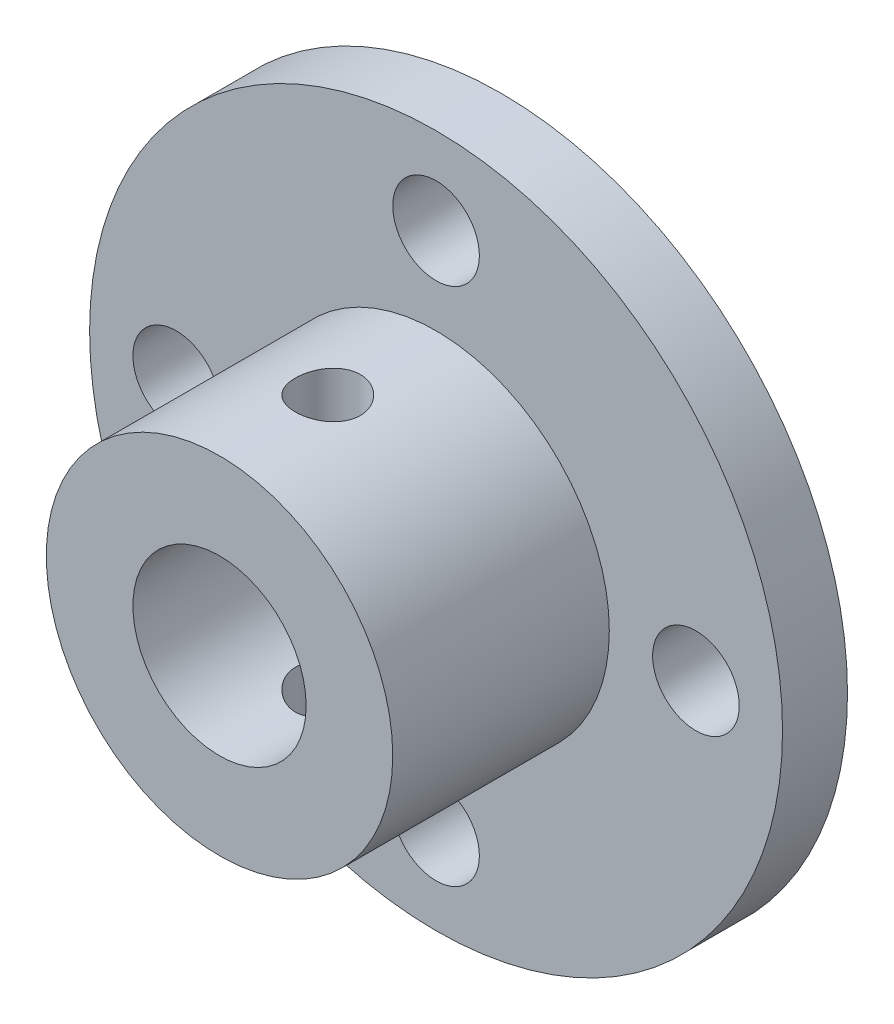
ISO-10303-21;
HEADER;
FILE_DESCRIPTION(('STEP AP214'),'2;1');
FILE_NAME('part.step','',(''),(''),'','','');
FILE_SCHEMA(('AUTOMOTIVE_DESIGN { 1 0 10303 214 1 1 1 1 }'));
ENDSEC;
DATA;
#1=APPLICATION_CONTEXT('core data for automotive mechanical design processes');
#2=APPLICATION_PROTOCOL_DEFINITION('international standard','automotive_design',2000,#1);
#3=PRODUCT_CONTEXT('',#1,'mechanical');
#4=PRODUCT('Part','Part','',(#3));
#5=PRODUCT_RELATED_PRODUCT_CATEGORY('part','',(#4));
#6=PRODUCT_DEFINITION_FORMATION('','',#4);
#7=PRODUCT_DEFINITION_CONTEXT('part definition',#1,'design');
#8=PRODUCT_DEFINITION('design','',#6,#7);
#9=PRODUCT_DEFINITION_SHAPE('','',#8);
#10=(LENGTH_UNIT() NAMED_UNIT(*) SI_UNIT(.MILLI.,.METRE.));
#11=(NAMED_UNIT(*) PLANE_ANGLE_UNIT() SI_UNIT($,.RADIAN.));
#12=(NAMED_UNIT(*) SI_UNIT($,.STERADIAN.) SOLID_ANGLE_UNIT());
#13=UNCERTAINTY_MEASURE_WITH_UNIT(LENGTH_MEASURE(1.E-05),#10,'distance_accuracy_value','');
#14=(GEOMETRIC_REPRESENTATION_CONTEXT(3) GLOBAL_UNCERTAINTY_ASSIGNED_CONTEXT((#13)) GLOBAL_UNIT_ASSIGNED_CONTEXT((#10,
#11,#12)) REPRESENTATION_CONTEXT('',''));
#15=CARTESIAN_POINT('',(0.,0.,0.));
#16=DIRECTION('',(0.,0.,1.));
#17=DIRECTION('',(1.,0.,0.));
#18=AXIS2_PLACEMENT_3D('',#15,#16,#17);
#19=CARTESIAN_POINT('',(0.,0.,3.));
#20=DIRECTION('',(0.,0.,-1.));
#21=DIRECTION('',(-1.,0.,0.));
#22=AXIS2_PLACEMENT_3D('',#19,#20,#21);
#23=CYLINDRICAL_SURFACE('',#22,16.);
#24=CARTESIAN_POINT('',(0.,0.,3.));
#25=DIRECTION('',(0.,0.,1.));
#26=DIRECTION('',(1.,0.,0.));
#27=AXIS2_PLACEMENT_3D('',#24,#25,#26);
#28=CIRCLE('',#27,16.);
#29=CARTESIAN_POINT('',(16.,0.,3.));
#30=VERTEX_POINT('',#29);
#31=EDGE_CURVE('E42',#30,#30,#28,.T.);
#32=ORIENTED_EDGE('',*,*,#31,.F.);
#33=EDGE_LOOP('',(#32));
#34=FACE_BOUND('',#33,.T.);
#35=CARTESIAN_POINT('',(0.,0.,0.));
#36=DIRECTION('',(0.,0.,1.));
#37=DIRECTION('',(1.,0.,0.));
#38=AXIS2_PLACEMENT_3D('',#35,#36,#37);
#39=CIRCLE('',#38,16.);
#40=CARTESIAN_POINT('',(16.,0.,0.));
#41=VERTEX_POINT('',#40);
#42=EDGE_CURVE('E47',#41,#41,#39,.T.);
#43=ORIENTED_EDGE('',*,*,#42,.T.);
#44=EDGE_LOOP('',(#43));
#45=FACE_BOUND('',#44,.T.);
#46=ADVANCED_FACE('F30',(#34,#45),#23,.T.);
#47=CARTESIAN_POINT('',(0.,0.,3.));
#48=DIRECTION('',(0.,0.,1.));
#49=DIRECTION('',(1.,0.,0.));
#50=AXIS2_PLACEMENT_3D('',#47,#48,#49);
#51=PLANE('',#50);
#52=CARTESIAN_POINT('',(12.,0.,3.));
#53=DIRECTION('',(0.,0.,1.));
#54=DIRECTION('',(1.,0.,0.));
#55=AXIS2_PLACEMENT_3D('',#52,#53,#54);
#56=CIRCLE('',#55,2.);
#57=CARTESIAN_POINT('',(14.,0.,3.));
#58=VERTEX_POINT('',#57);
#59=EDGE_CURVE('E210',#58,#58,#56,.T.);
#60=ORIENTED_EDGE('',*,*,#59,.F.);
#61=EDGE_LOOP('',(#60));
#62=FACE_BOUND('',#61,.T.);
#63=CARTESIAN_POINT('',(0.,12.,3.));
#64=DIRECTION('',(0.,0.,1.));
#65=DIRECTION('',(1.,0.,0.));
#66=AXIS2_PLACEMENT_3D('',#63,#64,#65);
#67=CIRCLE('',#66,2.);
#68=CARTESIAN_POINT('',(2.,12.,3.));
#69=VERTEX_POINT('',#68);
#70=EDGE_CURVE('E212',#69,#69,#67,.T.);
#71=ORIENTED_EDGE('',*,*,#70,.F.);
#72=EDGE_LOOP('',(#71));
#73=FACE_BOUND('',#72,.T.);
#74=CARTESIAN_POINT('',(-12.,0.,3.));
#75=DIRECTION('',(0.,0.,1.));
#76=DIRECTION('',(1.,0.,0.));
#77=AXIS2_PLACEMENT_3D('',#74,#75,#76);
#78=CIRCLE('',#77,2.);
#79=CARTESIAN_POINT('',(-10.,0.,3.));
#80=VERTEX_POINT('',#79);
#81=EDGE_CURVE('E215',#80,#80,#78,.T.);
#82=ORIENTED_EDGE('',*,*,#81,.F.);
#83=EDGE_LOOP('',(#82));
#84=FACE_BOUND('',#83,.T.);
#85=CARTESIAN_POINT('',(0.,-12.,3.));
#86=DIRECTION('',(0.,0.,1.));
#87=DIRECTION('',(1.,0.,0.));
#88=AXIS2_PLACEMENT_3D('',#85,#86,#87);
#89=CIRCLE('',#88,2.);
#90=CARTESIAN_POINT('',(2.,-12.,3.));
#91=VERTEX_POINT('',#90);
#92=EDGE_CURVE('E57',#91,#91,#89,.T.);
#93=ORIENTED_EDGE('',*,*,#92,.F.);
#94=EDGE_LOOP('',(#93));
#95=FACE_BOUND('',#94,.T.);
#96=CARTESIAN_POINT('',(0.,0.,3.));
#97=DIRECTION('',(0.,0.,1.));
#98=DIRECTION('',(1.,0.,0.));
#99=AXIS2_PLACEMENT_3D('',#96,#97,#98);
#100=CIRCLE('',#99,8.);
#101=CARTESIAN_POINT('',(8.,0.,3.));
#102=VERTEX_POINT('',#101);
#103=EDGE_CURVE('E10',#102,#102,#100,.T.);
#104=ORIENTED_EDGE('',*,*,#103,.F.);
#105=EDGE_LOOP('',(#104));
#106=FACE_BOUND('',#105,.T.);
#107=ORIENTED_EDGE('',*,*,#31,.T.);
#108=EDGE_LOOP('',(#107));
#109=FACE_BOUND('',#108,.T.);
#110=ADVANCED_FACE('F99',(#62,#73,#84,#95,#106,#109),#51,.T.);
#111=CARTESIAN_POINT('',(0.,0.,0.));
#112=DIRECTION('',(0.,0.,1.));
#113=DIRECTION('',(1.,0.,0.));
#114=AXIS2_PLACEMENT_3D('',#111,#112,#113);
#115=PLANE('',#114);
#116=CARTESIAN_POINT('',(12.,0.,0.));
#117=DIRECTION('',(0.,0.,1.));
#118=DIRECTION('',(1.,0.,0.));
#119=AXIS2_PLACEMENT_3D('',#116,#117,#118);
#120=CIRCLE('',#119,2.);
#121=CARTESIAN_POINT('',(14.,0.,0.));
#122=VERTEX_POINT('',#121);
#123=EDGE_CURVE('E224',#122,#122,#120,.T.);
#124=ORIENTED_EDGE('',*,*,#123,.T.);
#125=EDGE_LOOP('',(#124));
#126=FACE_BOUND('',#125,.T.);
#127=CARTESIAN_POINT('',(0.,12.,0.));
#128=DIRECTION('',(0.,0.,1.));
#129=DIRECTION('',(1.,0.,0.));
#130=AXIS2_PLACEMENT_3D('',#127,#128,#129);
#131=CIRCLE('',#130,2.);
#132=CARTESIAN_POINT('',(2.,12.,0.));
#133=VERTEX_POINT('',#132);
#134=EDGE_CURVE('E225',#133,#133,#131,.T.);
#135=ORIENTED_EDGE('',*,*,#134,.T.);
#136=EDGE_LOOP('',(#135));
#137=FACE_BOUND('',#136,.T.);
#138=CARTESIAN_POINT('',(-12.,0.,0.));
#139=DIRECTION('',(0.,0.,1.));
#140=DIRECTION('',(1.,0.,0.));
#141=AXIS2_PLACEMENT_3D('',#138,#139,#140);
#142=CIRCLE('',#141,2.);
#143=CARTESIAN_POINT('',(-10.,0.,0.));
#144=VERTEX_POINT('',#143);
#145=EDGE_CURVE('E228',#144,#144,#142,.T.);
#146=ORIENTED_EDGE('',*,*,#145,.T.);
#147=EDGE_LOOP('',(#146));
#148=FACE_BOUND('',#147,.T.);
#149=CARTESIAN_POINT('',(0.,-12.,0.));
#150=DIRECTION('',(0.,0.,1.));
#151=DIRECTION('',(1.,0.,0.));
#152=AXIS2_PLACEMENT_3D('',#149,#150,#151);
#153=CIRCLE('',#152,2.);
#154=CARTESIAN_POINT('',(2.,-12.,0.));
#155=VERTEX_POINT('',#154);
#156=EDGE_CURVE('E230',#155,#155,#153,.T.);
#157=ORIENTED_EDGE('',*,*,#156,.T.);
#158=EDGE_LOOP('',(#157));
#159=FACE_BOUND('',#158,.T.);
#160=CARTESIAN_POINT('',(0.,0.,0.));
#161=DIRECTION('',(0.,0.,1.));
#162=DIRECTION('',(1.,0.,0.));
#163=AXIS2_PLACEMENT_3D('',#160,#161,#162);
#164=CIRCLE('',#163,4.);
#165=CARTESIAN_POINT('',(4.,0.,0.));
#166=VERTEX_POINT('',#165);
#167=EDGE_CURVE('E58',#166,#166,#164,.T.);
#168=ORIENTED_EDGE('',*,*,#167,.T.);
#169=EDGE_LOOP('',(#168));
#170=FACE_BOUND('',#169,.T.);
#171=ORIENTED_EDGE('',*,*,#42,.F.);
#172=EDGE_LOOP('',(#171));
#173=FACE_BOUND('',#172,.T.);
#174=ADVANCED_FACE('F97',(#126,#137,#148,#159,#170,#173),#115,.F.);
#175=CARTESIAN_POINT('',(0.,0.,13.));
#176=DIRECTION('',(0.,0.,-1.));
#177=DIRECTION('',(-1.,0.,0.));
#178=AXIS2_PLACEMENT_3D('',#175,#176,#177);
#179=CYLINDRICAL_SURFACE('',#178,8.);
#180=CARTESIAN_POINT('',(0.,-8.,9.5));
#181=CARTESIAN_POINT('',(0.0834717464654709,-7.99999848833852,9.49999681041172));
#182=CARTESIAN_POINT('',(0.166984992730099,-7.99868009921714,9.49300892338062));
#183=CARTESIAN_POINT('',(0.331658129841797,-7.9935478589052,9.46526000488165));
#184=CARTESIAN_POINT('',(0.412815974152225,-7.98973190166897,9.44448734936027));
#185=CARTESIAN_POINT('',(0.570372961851801,-7.98003138765458,9.38982729874066));
#186=CARTESIAN_POINT('',(0.646776330685344,-7.97414869946483,9.35595174754746));
#187=CARTESIAN_POINT('',(0.792807973094007,-7.96095710599783,9.27608112307718));
#188=CARTESIAN_POINT('',(0.862436794477323,-7.9536483161829,9.23008703085518));
#189=CARTESIAN_POINT('',(0.993783715930502,-7.93831336430504,9.12670023199632));
#190=CARTESIAN_POINT('',(1.05540895503183,-7.93028034856351,9.06919055532986));
#191=CARTESIAN_POINT('',(1.16819606135369,-7.9144531845865,8.94465669091244));
#192=CARTESIAN_POINT('',(1.21935717689241,-7.90665905354527,8.87763182023071));
#193=CARTESIAN_POINT('',(1.31014998665793,-7.89212551245005,8.73531391163603));
#194=CARTESIAN_POINT('',(1.34968721969605,-7.88539493886182,8.65995962968276));
#195=CARTESIAN_POINT('',(1.41550524332283,-7.87384713211987,8.50353108482321));
#196=CARTESIAN_POINT('',(1.44178717713098,-7.86902973396962,8.42245731588878));
#197=CARTESIAN_POINT('',(1.480050535035,-7.8619226957455,8.25788476908559));
#198=CARTESIAN_POINT('',(1.49219390192039,-7.85960445366405,8.17442490279654));
#199=CARTESIAN_POINT('',(1.50233808095346,-7.85767197152761,8.00662261519175));
#200=CARTESIAN_POINT('',(1.50034016135374,-7.8580574889876,7.9222802736977));
#201=CARTESIAN_POINT('',(1.48238979602362,-7.86146292701753,7.75628047473396));
#202=CARTESIAN_POINT('',(1.46662149996045,-7.86444808147334,7.67460228569985));
#203=CARTESIAN_POINT('',(1.42186799396207,-7.87266183284666,7.51507158021739));
#204=CARTESIAN_POINT('',(1.39288222239499,-7.87789052509516,7.4372192264907));
#205=CARTESIAN_POINT('',(1.322336471793,-7.89003855292588,7.28701132099974));
#206=CARTESIAN_POINT('',(1.28070213532456,-7.89696783823366,7.21469152941919));
#207=CARTESIAN_POINT('',(1.18609368930416,-7.91172971602918,7.07799527145977));
#208=CARTESIAN_POINT('',(1.13311842889266,-7.91956240015522,7.0136196122852));
#209=CARTESIAN_POINT('',(1.01633905685298,-7.93540001272164,6.89357504432754));
#210=CARTESIAN_POINT('',(0.952377436860683,-7.9434057102403,6.83805934754826));
#211=CARTESIAN_POINT('',(0.815968037098827,-7.95857386108318,6.73852275932459));
#212=CARTESIAN_POINT('',(0.74352017225577,-7.96573630595245,6.69450198312958));
#213=CARTESIAN_POINT('',(0.592034988874669,-7.97842539677509,6.61918224612998));
#214=CARTESIAN_POINT('',(0.512989564446494,-7.98394999136289,6.58789922088211));
#215=CARTESIAN_POINT('',(0.350639115398697,-7.99272505402719,6.53909790690784));
#216=CARTESIAN_POINT('',(0.267334544277787,-7.99597576367994,6.52157815595464));
#217=CARTESIAN_POINT('',(0.100148652903386,-7.99980360641981,6.50101396898173));
#218=CARTESIAN_POINT('',(0.0162940126341359,-8.00041950912279,6.49775960847027));
#219=CARTESIAN_POINT('',(-0.150761248092183,-7.99901543598228,6.50525547954765));
#220=CARTESIAN_POINT('',(-0.233961900480385,-7.99699558964431,6.51600502306526));
#221=CARTESIAN_POINT('',(-0.396681573218217,-7.99057111500406,6.55102903518337));
#222=CARTESIAN_POINT('',(-0.476224261046063,-7.98618522374031,6.57519728253781));
#223=CARTESIAN_POINT('',(-0.630128631824633,-7.97551842212498,6.63625770677879));
#224=CARTESIAN_POINT('',(-0.704489962595103,-7.96923738311334,6.67315074756578));
#225=CARTESIAN_POINT('',(-0.846816671513214,-7.95538030357666,6.75907812815951));
#226=CARTESIAN_POINT('',(-0.914703277015121,-7.94779086174563,6.80824073853684));
#227=CARTESIAN_POINT('',(-1.04133832326455,-7.93219343489712,6.91713813736236));
#228=CARTESIAN_POINT('',(-1.10008590976087,-7.92418541084687,6.97687391300133));
#229=CARTESIAN_POINT('',(-1.20757295872048,-7.9085247569745,7.10617231891143));
#230=CARTESIAN_POINT('',(-1.25616916218577,-7.90087825860257,7.17585490812539));
#231=CARTESIAN_POINT('',(-1.34096675057787,-7.88692985578532,7.32251762452375));
#232=CARTESIAN_POINT('',(-1.37716859613924,-7.8806279013735,7.39949748037047));
#233=CARTESIAN_POINT('',(-1.43594673512823,-7.87013024209574,7.55820586724254));
#234=CARTESIAN_POINT('',(-1.45858868794786,-7.86592440436878,7.63990937955933));
#235=CARTESIAN_POINT('',(-1.48980679326235,-7.86007203802415,7.8060472225214));
#236=CARTESIAN_POINT('',(-1.49838453270708,-7.8584252206579,7.8904812439704));
#237=CARTESIAN_POINT('',(-1.50117762148355,-7.85789199803857,8.05824833144151));
#238=CARTESIAN_POINT('',(-1.49561895003499,-7.85896215974293,8.14157758095699));
#239=CARTESIAN_POINT('',(-1.47079175378803,-7.86364600659998,8.30609142204529));
#240=CARTESIAN_POINT('',(-1.45152331089332,-7.86725967655747,8.38727602642744));
#241=CARTESIAN_POINT('',(-1.39991887583263,-7.8766050802318,8.54507448479548));
#242=CARTESIAN_POINT('',(-1.36760735397252,-7.88233284594965,8.62169659134577));
#243=CARTESIAN_POINT('',(-1.29085868912204,-7.8952638755184,8.76846825424084));
#244=CARTESIAN_POINT('',(-1.24642068948186,-7.90246724360119,8.83861735284478));
#245=CARTESIAN_POINT('',(-1.14589487339535,-7.91767266107745,8.97158368004229));
#246=CARTESIAN_POINT('',(-1.08964259864303,-7.92568505353043,9.0342754125671));
#247=CARTESIAN_POINT('',(-0.96742792674229,-7.94152833918735,9.14940516246452));
#248=CARTESIAN_POINT('',(-0.901463301891616,-7.94935919027328,9.20184082098014));
#249=CARTESIAN_POINT('',(-0.760984945071872,-7.96403975968049,9.29541095262706));
#250=CARTESIAN_POINT('',(-0.686399590640516,-7.97088000990561,9.33643942849064));
#251=CARTESIAN_POINT('',(-0.531290113653833,-7.98271619380687,9.40531763660514));
#252=CARTESIAN_POINT('',(-0.450771651705247,-7.98771385879037,9.43317974704691));
#253=CARTESIAN_POINT('',(-0.308347202825154,-7.99428290707632,9.46927731441867));
#254=CARTESIAN_POINT('',(-0.24727381025187,-7.99641470878206,9.4807786303128));
#255=CARTESIAN_POINT('',(-0.124141247115158,-7.9992737995401,9.49614106211645));
#256=CARTESIAN_POINT('',(-0.0620821016527095,-8.00000112429805,9.50000237225591));
#257=CARTESIAN_POINT('',(0.,-8.,9.5));
#258=B_SPLINE_CURVE_WITH_KNOTS('',3,(#180,#181,#182,#183,#184,#185,#186,#187,#188,#189,#190,
#191,#192,#193,#194,#195,#196,#197,#198,#199,#200,#201,#202,#203,#204,#205,#206,#207,#208,#209,
#210,#211,#212,#213,#214,#215,#216,#217,#218,#219,#220,#221,#222,#223,#224,#225,#226,#227,#228,
#229,#230,#231,#232,#233,#234,#235,#236,#237,#238,#239,#240,#241,#242,#243,#244,#245,#246,#247,
#248,#249,#250,#251,#252,#253,#254,#255,#256,#257),.UNSPECIFIED.,.T.,.F.,(4,2,2,2,2,2,2,2,2,2,2,
2,2,2,2,2,2,2,2,2,2,2,2,2,2,2,2,2,2,2,2,2,2,2,2,2,2,2,4),(0.,0.250188200964924,
0.500587642535452,0.750761271230907,1.00091465336891,1.2537511801363,1.50660586283617,
1.76146190504357,2.01629596311948,2.26818151445336,2.52004447587256,2.76859000612765,
3.01714609846786,3.2671926262953,3.51726454049859,3.77127768464077,4.02529337544948,
4.27962588321699,4.53393136673745,4.78448174076097,5.03501980464583,5.28360233907828,
5.53220175338032,5.78351778017708,6.03485728413098,6.28953436987299,6.54420198954945,
6.79762627818559,7.05102196946512,7.30039252231748,7.54976158541506,7.79866496207692,
8.04758592655423,8.3002336996638,8.55293951262255,8.80792048916315,9.06266126931173,
9.24874344524409,9.43482089039541),.UNSPECIFIED.);
#259=CARTESIAN_POINT('',(0.,-8.,9.5));
#260=VERTEX_POINT('',#259);
#261=EDGE_CURVE('E87',#260,#260,#258,.T.);
#262=ORIENTED_EDGE('',*,*,#261,.T.);
#263=EDGE_LOOP('',(#262));
#264=FACE_BOUND('',#263,.T.);
#265=CARTESIAN_POINT('',(0.,8.,9.5));
#266=CARTESIAN_POINT('',(-0.0834717464654709,7.99999848833852,9.49999681041172));
#267=CARTESIAN_POINT('',(-0.166984992730099,7.99868009921714,9.49300892338062));
#268=CARTESIAN_POINT('',(-0.331658129841797,7.9935478589052,9.46526000488165));
#269=CARTESIAN_POINT('',(-0.412815974152225,7.98973190166897,9.44448734936027));
#270=CARTESIAN_POINT('',(-0.570372961851801,7.98003138765458,9.38982729874066));
#271=CARTESIAN_POINT('',(-0.646776330685344,7.97414869946483,9.35595174754746));
#272=CARTESIAN_POINT('',(-0.792807973094007,7.96095710599783,9.27608112307718));
#273=CARTESIAN_POINT('',(-0.862436794477323,7.9536483161829,9.23008703085518));
#274=CARTESIAN_POINT('',(-0.993783715930502,7.93831336430504,9.12670023199632));
#275=CARTESIAN_POINT('',(-1.05540895503183,7.93028034856351,9.06919055532986));
#276=CARTESIAN_POINT('',(-1.16819606135369,7.9144531845865,8.94465669091244));
#277=CARTESIAN_POINT('',(-1.21935717689241,7.90665905354527,8.87763182023071));
#278=CARTESIAN_POINT('',(-1.31014998665793,7.89212551245005,8.73531391163603));
#279=CARTESIAN_POINT('',(-1.34968721969605,7.88539493886182,8.65995962968276));
#280=CARTESIAN_POINT('',(-1.41550524332283,7.87384713211987,8.50353108482321));
#281=CARTESIAN_POINT('',(-1.44178717713098,7.86902973396962,8.42245731588878));
#282=CARTESIAN_POINT('',(-1.480050535035,7.8619226957455,8.25788476908559));
#283=CARTESIAN_POINT('',(-1.49219390192039,7.85960445366405,8.17442490279654));
#284=CARTESIAN_POINT('',(-1.50233808095346,7.85767197152761,8.00662261519175));
#285=CARTESIAN_POINT('',(-1.50034016135374,7.8580574889876,7.9222802736977));
#286=CARTESIAN_POINT('',(-1.48238979602362,7.86146292701753,7.75628047473396));
#287=CARTESIAN_POINT('',(-1.46662149996045,7.86444808147334,7.67460228569985));
#288=CARTESIAN_POINT('',(-1.42186799396207,7.87266183284666,7.51507158021739));
#289=CARTESIAN_POINT('',(-1.39288222239499,7.87789052509516,7.4372192264907));
#290=CARTESIAN_POINT('',(-1.322336471793,7.89003855292588,7.28701132099974));
#291=CARTESIAN_POINT('',(-1.28070213532456,7.89696783823366,7.21469152941919));
#292=CARTESIAN_POINT('',(-1.18609368930416,7.91172971602918,7.07799527145977));
#293=CARTESIAN_POINT('',(-1.13311842889266,7.91956240015522,7.0136196122852));
#294=CARTESIAN_POINT('',(-1.01633905685298,7.93540001272164,6.89357504432754));
#295=CARTESIAN_POINT('',(-0.952377436860683,7.9434057102403,6.83805934754826));
#296=CARTESIAN_POINT('',(-0.815968037098827,7.95857386108318,6.73852275932459));
#297=CARTESIAN_POINT('',(-0.74352017225577,7.96573630595245,6.69450198312958));
#298=CARTESIAN_POINT('',(-0.592034988874669,7.97842539677509,6.61918224612998));
#299=CARTESIAN_POINT('',(-0.512989564446494,7.98394999136289,6.58789922088211));
#300=CARTESIAN_POINT('',(-0.350639115398697,7.99272505402719,6.53909790690784));
#301=CARTESIAN_POINT('',(-0.267334544277787,7.99597576367994,6.52157815595464));
#302=CARTESIAN_POINT('',(-0.100148652903386,7.99980360641981,6.50101396898173));
#303=CARTESIAN_POINT('',(-0.0162940126341359,8.00041950912279,6.49775960847027));
#304=CARTESIAN_POINT('',(0.150761248092183,7.99901543598228,6.50525547954765));
#305=CARTESIAN_POINT('',(0.233961900480385,7.99699558964431,6.51600502306526));
#306=CARTESIAN_POINT('',(0.396681573218217,7.99057111500406,6.55102903518337));
#307=CARTESIAN_POINT('',(0.476224261046063,7.98618522374031,6.57519728253781));
#308=CARTESIAN_POINT('',(0.630128631824633,7.97551842212498,6.63625770677879));
#309=CARTESIAN_POINT('',(0.704489962595103,7.96923738311334,6.67315074756578));
#310=CARTESIAN_POINT('',(0.846816671513214,7.95538030357666,6.75907812815951));
#311=CARTESIAN_POINT('',(0.914703277015121,7.94779086174563,6.80824073853684));
#312=CARTESIAN_POINT('',(1.04133832326455,7.93219343489712,6.91713813736236));
#313=CARTESIAN_POINT('',(1.10008590976087,7.92418541084687,6.97687391300133));
#314=CARTESIAN_POINT('',(1.20757295872048,7.9085247569745,7.10617231891143));
#315=CARTESIAN_POINT('',(1.25616916218577,7.90087825860257,7.17585490812539));
#316=CARTESIAN_POINT('',(1.34096675057787,7.88692985578532,7.32251762452375));
#317=CARTESIAN_POINT('',(1.37716859613924,7.8806279013735,7.39949748037047));
#318=CARTESIAN_POINT('',(1.43594673512823,7.87013024209574,7.55820586724254));
#319=CARTESIAN_POINT('',(1.45858868794786,7.86592440436878,7.63990937955933));
#320=CARTESIAN_POINT('',(1.48980679326235,7.86007203802415,7.8060472225214));
#321=CARTESIAN_POINT('',(1.49838453270708,7.8584252206579,7.8904812439704));
#322=CARTESIAN_POINT('',(1.50117762148355,7.85789199803857,8.05824833144151));
#323=CARTESIAN_POINT('',(1.49561895003499,7.85896215974293,8.14157758095699));
#324=CARTESIAN_POINT('',(1.47079175378803,7.86364600659998,8.30609142204529));
#325=CARTESIAN_POINT('',(1.45152331089332,7.86725967655747,8.38727602642744));
#326=CARTESIAN_POINT('',(1.39991887583263,7.8766050802318,8.54507448479548));
#327=CARTESIAN_POINT('',(1.36760735397252,7.88233284594965,8.62169659134577));
#328=CARTESIAN_POINT('',(1.29085868912204,7.8952638755184,8.76846825424084));
#329=CARTESIAN_POINT('',(1.24642068948186,7.90246724360119,8.83861735284478));
#330=CARTESIAN_POINT('',(1.14589487339535,7.91767266107745,8.97158368004229));
#331=CARTESIAN_POINT('',(1.08964259864303,7.92568505353043,9.0342754125671));
#332=CARTESIAN_POINT('',(0.96742792674229,7.94152833918735,9.14940516246452));
#333=CARTESIAN_POINT('',(0.901463301891616,7.94935919027328,9.20184082098014));
#334=CARTESIAN_POINT('',(0.760984945071872,7.96403975968049,9.29541095262706));
#335=CARTESIAN_POINT('',(0.686399590640516,7.97088000990561,9.33643942849064));
#336=CARTESIAN_POINT('',(0.531290113653833,7.98271619380687,9.40531763660514));
#337=CARTESIAN_POINT('',(0.450771651705247,7.98771385879037,9.43317974704691));
#338=CARTESIAN_POINT('',(0.308347202825154,7.99428290707632,9.46927731441867));
#339=CARTESIAN_POINT('',(0.24727381025187,7.99641470878206,9.4807786303128));
#340=CARTESIAN_POINT('',(0.124141247115158,7.9992737995401,9.49614106211645));
#341=CARTESIAN_POINT('',(0.0620821016527095,8.00000112429805,9.50000237225591));
#342=CARTESIAN_POINT('',(0.,8.,9.5));
#343=B_SPLINE_CURVE_WITH_KNOTS('',3,(#265,#266,#267,#268,#269,#270,#271,#272,#273,#274,#275,
#276,#277,#278,#279,#280,#281,#282,#283,#284,#285,#286,#287,#288,#289,#290,#291,#292,#293,#294,
#295,#296,#297,#298,#299,#300,#301,#302,#303,#304,#305,#306,#307,#308,#309,#310,#311,#312,#313,
#314,#315,#316,#317,#318,#319,#320,#321,#322,#323,#324,#325,#326,#327,#328,#329,#330,#331,#332,
#333,#334,#335,#336,#337,#338,#339,#340,#341,#342),.UNSPECIFIED.,.T.,.F.,(4,2,2,2,2,2,2,2,2,2,2,
2,2,2,2,2,2,2,2,2,2,2,2,2,2,2,2,2,2,2,2,2,2,2,2,2,2,2,4),(0.,0.250188200964924,
0.500587642535452,0.750761271230907,1.00091465336891,1.2537511801363,1.50660586283617,
1.76146190504357,2.01629596311948,2.26818151445336,2.52004447587256,2.76859000612765,
3.01714609846786,3.2671926262953,3.51726454049859,3.77127768464077,4.02529337544948,
4.27962588321699,4.53393136673745,4.78448174076097,5.03501980464583,5.28360233907828,
5.53220175338032,5.78351778017708,6.03485728413098,6.28953436987299,6.54420198954945,
6.79762627818559,7.05102196946512,7.30039252231748,7.54976158541506,7.79866496207692,
8.04758592655423,8.3002336996638,8.55293951262255,8.80792048916315,9.06266126931173,
9.24874344524409,9.43482089039541),.UNSPECIFIED.);
#344=CARTESIAN_POINT('',(0.,8.,9.5));
#345=VERTEX_POINT('',#344);
#346=EDGE_CURVE('E81',#345,#345,#343,.T.);
#347=ORIENTED_EDGE('',*,*,#346,.T.);
#348=EDGE_LOOP('',(#347));
#349=FACE_BOUND('',#348,.T.);
#350=CARTESIAN_POINT('',(0.,0.,13.));
#351=DIRECTION('',(0.,0.,1.));
#352=DIRECTION('',(1.,0.,0.));
#353=AXIS2_PLACEMENT_3D('',#350,#351,#352);
#354=CIRCLE('',#353,8.);
#355=CARTESIAN_POINT('',(8.,0.,13.));
#356=VERTEX_POINT('',#355);
#357=EDGE_CURVE('E50',#356,#356,#354,.T.);
#358=ORIENTED_EDGE('',*,*,#357,.F.);
#359=EDGE_LOOP('',(#358));
#360=FACE_BOUND('',#359,.T.);
#361=ORIENTED_EDGE('',*,*,#103,.T.);
#362=EDGE_LOOP('',(#361));
#363=FACE_BOUND('',#362,.T.);
#364=ADVANCED_FACE('F92',(#264,#349,#360,#363),#179,.T.);
#365=CARTESIAN_POINT('',(0.,0.,13.));
#366=DIRECTION('',(0.,0.,1.));
#367=DIRECTION('',(1.,0.,0.));
#368=AXIS2_PLACEMENT_3D('',#365,#366,#367);
#369=PLANE('',#368);
#370=CARTESIAN_POINT('',(0.,0.,13.));
#371=DIRECTION('',(0.,0.,1.));
#372=DIRECTION('',(1.,0.,0.));
#373=AXIS2_PLACEMENT_3D('',#370,#371,#372);
#374=CIRCLE('',#373,4.);
#375=CARTESIAN_POINT('',(4.,0.,13.));
#376=VERTEX_POINT('',#375);
#377=EDGE_CURVE('E55',#376,#376,#374,.T.);
#378=ORIENTED_EDGE('',*,*,#377,.F.);
#379=EDGE_LOOP('',(#378));
#380=FACE_BOUND('',#379,.T.);
#381=ORIENTED_EDGE('',*,*,#357,.T.);
#382=EDGE_LOOP('',(#381));
#383=FACE_BOUND('',#382,.T.);
#384=ADVANCED_FACE('F96',(#380,#383),#369,.T.);
#385=CARTESIAN_POINT('',(0.,0.,0.));
#386=DIRECTION('',(0.,0.,1.));
#387=DIRECTION('',(1.,0.,0.));
#388=AXIS2_PLACEMENT_3D('',#385,#386,#387);
#389=CYLINDRICAL_SURFACE('',#388,4.);
#390=CARTESIAN_POINT('',(0.,-4.,9.5));
#391=CARTESIAN_POINT('',(-0.0812350589378527,-4.00000217456151,9.50000290230311));
#392=CARTESIAN_POINT('',(-0.162450241781792,-3.99750379283184,9.49338023975162));
#393=CARTESIAN_POINT('',(-0.322453452352361,-3.98778696006928,9.46717180473007));
#394=CARTESIAN_POINT('',(-0.401241827987616,-3.98056918893993,9.44758789952943));
#395=CARTESIAN_POINT('',(-0.554060784990878,-3.96218832391545,9.39624699822824));
#396=CARTESIAN_POINT('',(-0.628100224162277,-3.9510328434944,9.36451348317821));
#397=CARTESIAN_POINT('',(-0.769799310160253,-3.92588767765353,9.28989358698418));
#398=CARTESIAN_POINT('',(-0.837457239177879,-3.91189723227548,9.24700421445585));
#399=CARTESIAN_POINT('',(-0.967346417045825,-3.88186246971217,9.14938746892909));
#400=CARTESIAN_POINT('',(-1.02927073015119,-3.86576002583566,9.0942697377406));
#401=CARTESIAN_POINT('',(-1.14324421474363,-3.83360220871327,8.97458956534116));
#402=CARTESIAN_POINT('',(-1.19529036359203,-3.81754685135033,8.91002424391213));
#403=CARTESIAN_POINT('',(-1.28998202215985,-3.78662470617731,8.77028253247679));
#404=CARTESIAN_POINT('',(-1.3321939319576,-3.77182648820818,8.69479563345418));
#405=CARTESIAN_POINT('',(-1.40318646334084,-3.74599860237433,8.53715164583148));
#406=CARTESIAN_POINT('',(-1.43197244961239,-3.73496742975881,8.4549972368449));
#407=CARTESIAN_POINT('',(-1.47408431017549,-3.71854412824136,8.2898832597418));
#408=CARTESIAN_POINT('',(-1.48799593218558,-3.71293924350838,8.20709496156456));
#409=CARTESIAN_POINT('',(-1.50179556531648,-3.70738061461215,8.04018384200616));
#410=CARTESIAN_POINT('',(-1.50168936802631,-3.70742453659305,7.95606158612553));
#411=CARTESIAN_POINT('',(-1.48790429610018,-3.71297511632055,7.79423047478705));
#412=CARTESIAN_POINT('',(-1.47503808509004,-3.71815468871122,7.71643909395582));
#413=CARTESIAN_POINT('',(-1.4374416786833,-3.73284938059529,7.56421284959468));
#414=CARTESIAN_POINT('',(-1.41270969663258,-3.74236515298863,7.48977849338612));
#415=CARTESIAN_POINT('',(-1.35163748571904,-3.76485702190253,7.34472293227177));
#416=CARTESIAN_POINT('',(-1.31508648737101,-3.77789517988166,7.2742005138787));
#417=CARTESIAN_POINT('',(-1.23156073762698,-3.80594210139319,7.14005426240903));
#418=CARTESIAN_POINT('',(-1.18458238728897,-3.82095154457158,7.0764328224803));
#419=CARTESIAN_POINT('',(-1.07781780766549,-3.85248038859113,6.95339633634912));
#420=CARTESIAN_POINT('',(-1.01738298716956,-3.86903347455671,6.89455135925191));
#421=CARTESIAN_POINT('',(-0.887312590819021,-3.90091728164085,6.7876620337942));
#422=CARTESIAN_POINT('',(-0.817675603497364,-3.91624781465952,6.73961934539433));
#423=CARTESIAN_POINT('',(-0.66972343699242,-3.9442639480908,6.65506960293748));
#424=CARTESIAN_POINT('',(-0.59129071384472,-3.95690498259616,6.61875241877894));
#425=CARTESIAN_POINT('',(-0.428836850524584,-3.97778718326962,6.56001739572996));
#426=CARTESIAN_POINT('',(-0.344818210845768,-3.98603030341493,6.53759338343888));
#427=CARTESIAN_POINT('',(-0.178375243148666,-3.99684443228065,6.50837721245806));
#428=CARTESIAN_POINT('',(-0.0961036195622098,-3.99969369025686,6.50081739361749));
#429=CARTESIAN_POINT('',(0.0685724752550238,-4.00025893700126,6.49930893610008));
#430=CARTESIAN_POINT('',(0.150976912983372,-3.99797606386863,6.50535727968322));
#431=CARTESIAN_POINT('',(0.310262048561859,-3.98871709772643,6.53031004230867));
#432=CARTESIAN_POINT('',(0.387233328007336,-3.98192470962305,6.54871154373709));
#433=CARTESIAN_POINT('',(0.536941754957221,-3.96451477091717,6.59718607254732));
#434=CARTESIAN_POINT('',(0.609678350347534,-3.9538967228203,6.62726061794803));
#435=CARTESIAN_POINT('',(0.751247765110155,-3.92949624407681,6.69918641243947));
#436=CARTESIAN_POINT('',(0.819903083557795,-3.91563000209348,6.74135772922338));
#437=CARTESIAN_POINT('',(0.949392711726625,-3.88626671564664,6.83591810317156));
#438=CARTESIAN_POINT('',(1.01022412027045,-3.87076907009516,6.88831093254515));
#439=CARTESIAN_POINT('',(1.12603079874454,-3.8387332949099,7.00540412212427));
#440=CARTESIAN_POINT('',(1.18046154123569,-3.82218696503729,7.0706421827727));
#441=CARTESIAN_POINT('',(1.27771050031903,-3.79078815746854,7.20965138470766));
#442=CARTESIAN_POINT('',(1.32052767414518,-3.77593583194399,7.2834232913885));
#443=CARTESIAN_POINT('',(1.39337773518998,-3.74966829822463,7.43801598677231));
#444=CARTESIAN_POINT('',(1.42335685446918,-3.73826760328493,7.51886474591044));
#445=CARTESIAN_POINT('',(1.46907883466889,-3.72054032891005,7.68500976368782));
#446=CARTESIAN_POINT('',(1.48483050305535,-3.71421061057491,7.77030323619812));
#447=CARTESIAN_POINT('',(1.50086347097839,-3.70775894792573,7.93701615954111));
#448=CARTESIAN_POINT('',(1.50207331495837,-3.70726444523341,8.01833263171689));
#449=CARTESIAN_POINT('',(1.49136715641593,-3.71158412745292,8.17994531627617));
#450=CARTESIAN_POINT('',(1.47945239850124,-3.71639780898899,8.26024162467158));
#451=CARTESIAN_POINT('',(1.44355815630242,-3.73048141585432,8.41504722671655));
#452=CARTESIAN_POINT('',(1.41995798316524,-3.73961085376663,8.48965834624535));
#453=CARTESIAN_POINT('',(1.3616969677992,-3.76121548297845,8.63390550849442));
#454=CARTESIAN_POINT('',(1.32703332944945,-3.77369151995215,8.70354028807014));
#455=CARTESIAN_POINT('',(1.24552075938154,-3.80139723903965,8.83982678969763));
#456=CARTESIAN_POINT('',(1.1981283280301,-3.81673698440964,8.90613079679991));
#457=CARTESIAN_POINT('',(1.09334485729906,-3.84806246757177,9.03014156097121));
#458=CARTESIAN_POINT('',(1.03595064012808,-3.86404840943145,9.08784557478675));
#459=CARTESIAN_POINT('',(0.909080396784624,-3.89590424609881,9.19620195582184));
#460=CARTESIAN_POINT('',(0.839118644212993,-3.91172104900645,9.24630375343467));
#461=CARTESIAN_POINT('',(0.691213223200822,-3.94054514457031,9.33402265527655));
#462=CARTESIAN_POINT('',(0.613268934090622,-3.95355221851559,9.37163878773637));
#463=CARTESIAN_POINT('',(0.447999082002313,-3.9757429260668,9.43437682904833));
#464=CARTESIAN_POINT('',(0.36041342223421,-3.98473657158356,9.4588870646019));
#465=CARTESIAN_POINT('',(0.181875733606383,-3.99686242179587,9.49169295992068));
#466=CARTESIAN_POINT('',(0.0909254163648595,-3.99999756603967,9.49999675148732));
#467=CARTESIAN_POINT('',(0.,-4.,9.5));
#468=B_SPLINE_CURVE_WITH_KNOTS('',3,(#390,#391,#392,#393,#394,#395,#396,#397,#398,#399,#400,
#401,#402,#403,#404,#405,#406,#407,#408,#409,#410,#411,#412,#413,#414,#415,#416,#417,#418,#419,
#420,#421,#422,#423,#424,#425,#426,#427,#428,#429,#430,#431,#432,#433,#434,#435,#436,#437,#438,
#439,#440,#441,#442,#443,#444,#445,#446,#447,#448,#449,#450,#451,#452,#453,#454,#455,#456,#457,
#458,#459,#460,#461,#462,#463,#464,#465,#466,#467),.UNSPECIFIED.,.T.,.F.,(4,2,2,2,2,2,2,2,2,2,2,
2,2,2,2,2,2,2,2,2,2,2,2,2,2,2,2,2,2,2,2,2,2,2,2,2,2,2,4),(0.,0.243369801560559,0.48670454953046,
0.729571369213572,0.972503379609489,1.22473618582715,1.47704604925622,1.73896674501658,
2.00078269352134,2.25185874416901,2.50283106079707,2.73878345119971,2.97477138060589,
3.21522408387018,3.45575990744258,3.71246153335813,3.96920257905066,4.22991375286075,
4.49050899698846,4.73725019635925,4.9839366839052,5.2211443792384,5.45838293254453,
5.70259221859599,5.94689180019868,6.20536519455658,6.46386178920141,6.72343066727204,
6.98283874956507,7.22558763480252,7.46831350211259,7.70363142426533,7.93900886656506,
8.18672471884271,8.43451941997062,8.69572329654039,8.95694749805102,9.22948515032042,
9.50188601796127),.UNSPECIFIED.);
#469=CARTESIAN_POINT('',(0.,-4.,9.5));
#470=VERTEX_POINT('',#469);
#471=EDGE_CURVE('E33',#470,#470,#468,.T.);
#472=ORIENTED_EDGE('',*,*,#471,.T.);
#473=EDGE_LOOP('',(#472));
#474=FACE_BOUND('',#473,.T.);
#475=CARTESIAN_POINT('',(0.,4.,9.5));
#476=CARTESIAN_POINT('',(0.0812350589378527,4.00000217456151,9.50000290230311));
#477=CARTESIAN_POINT('',(0.162450241781792,3.99750379283184,9.49338023975162));
#478=CARTESIAN_POINT('',(0.322453452352361,3.98778696006928,9.46717180473007));
#479=CARTESIAN_POINT('',(0.401241827987616,3.98056918893993,9.44758789952943));
#480=CARTESIAN_POINT('',(0.554060784990878,3.96218832391545,9.39624699822824));
#481=CARTESIAN_POINT('',(0.628100224162277,3.9510328434944,9.36451348317821));
#482=CARTESIAN_POINT('',(0.769799310160253,3.92588767765353,9.28989358698418));
#483=CARTESIAN_POINT('',(0.837457239177879,3.91189723227548,9.24700421445585));
#484=CARTESIAN_POINT('',(0.967346417045825,3.88186246971217,9.14938746892909));
#485=CARTESIAN_POINT('',(1.02927073015119,3.86576002583566,9.0942697377406));
#486=CARTESIAN_POINT('',(1.14324421474363,3.83360220871327,8.97458956534116));
#487=CARTESIAN_POINT('',(1.19529036359203,3.81754685135033,8.91002424391213));
#488=CARTESIAN_POINT('',(1.28998202215985,3.78662470617731,8.77028253247679));
#489=CARTESIAN_POINT('',(1.3321939319576,3.77182648820818,8.69479563345418));
#490=CARTESIAN_POINT('',(1.40318646334084,3.74599860237433,8.53715164583148));
#491=CARTESIAN_POINT('',(1.43197244961239,3.73496742975881,8.4549972368449));
#492=CARTESIAN_POINT('',(1.47408431017549,3.71854412824136,8.2898832597418));
#493=CARTESIAN_POINT('',(1.48799593218558,3.71293924350838,8.20709496156456));
#494=CARTESIAN_POINT('',(1.50179556531648,3.70738061461215,8.04018384200616));
#495=CARTESIAN_POINT('',(1.50168936802631,3.70742453659305,7.95606158612553));
#496=CARTESIAN_POINT('',(1.48790429610018,3.71297511632055,7.79423047478705));
#497=CARTESIAN_POINT('',(1.47503808509004,3.71815468871122,7.71643909395582));
#498=CARTESIAN_POINT('',(1.4374416786833,3.73284938059529,7.56421284959468));
#499=CARTESIAN_POINT('',(1.41270969663258,3.74236515298863,7.48977849338612));
#500=CARTESIAN_POINT('',(1.35163748571904,3.76485702190253,7.34472293227177));
#501=CARTESIAN_POINT('',(1.31508648737101,3.77789517988166,7.2742005138787));
#502=CARTESIAN_POINT('',(1.23156073762698,3.80594210139319,7.14005426240903));
#503=CARTESIAN_POINT('',(1.18458238728897,3.82095154457158,7.0764328224803));
#504=CARTESIAN_POINT('',(1.07781780766549,3.85248038859113,6.95339633634912));
#505=CARTESIAN_POINT('',(1.01738298716956,3.86903347455671,6.89455135925191));
#506=CARTESIAN_POINT('',(0.887312590819021,3.90091728164085,6.7876620337942));
#507=CARTESIAN_POINT('',(0.817675603497364,3.91624781465952,6.73961934539433));
#508=CARTESIAN_POINT('',(0.66972343699242,3.9442639480908,6.65506960293748));
#509=CARTESIAN_POINT('',(0.59129071384472,3.95690498259616,6.61875241877894));
#510=CARTESIAN_POINT('',(0.428836850524584,3.97778718326962,6.56001739572996));
#511=CARTESIAN_POINT('',(0.344818210845768,3.98603030341493,6.53759338343888));
#512=CARTESIAN_POINT('',(0.178375243148666,3.99684443228065,6.50837721245806));
#513=CARTESIAN_POINT('',(0.0961036195622098,3.99969369025686,6.50081739361749));
#514=CARTESIAN_POINT('',(-0.0685724752550238,4.00025893700126,6.49930893610008));
#515=CARTESIAN_POINT('',(-0.150976912983372,3.99797606386863,6.50535727968322));
#516=CARTESIAN_POINT('',(-0.310262048561859,3.98871709772643,6.53031004230867));
#517=CARTESIAN_POINT('',(-0.387233328007336,3.98192470962305,6.54871154373709));
#518=CARTESIAN_POINT('',(-0.536941754957221,3.96451477091717,6.59718607254732));
#519=CARTESIAN_POINT('',(-0.609678350347534,3.9538967228203,6.62726061794803));
#520=CARTESIAN_POINT('',(-0.751247765110155,3.92949624407681,6.69918641243947));
#521=CARTESIAN_POINT('',(-0.819903083557795,3.91563000209348,6.74135772922338));
#522=CARTESIAN_POINT('',(-0.949392711726625,3.88626671564664,6.83591810317156));
#523=CARTESIAN_POINT('',(-1.01022412027045,3.87076907009516,6.88831093254515));
#524=CARTESIAN_POINT('',(-1.12603079874454,3.8387332949099,7.00540412212427));
#525=CARTESIAN_POINT('',(-1.18046154123569,3.82218696503729,7.0706421827727));
#526=CARTESIAN_POINT('',(-1.27771050031903,3.79078815746854,7.20965138470766));
#527=CARTESIAN_POINT('',(-1.32052767414518,3.77593583194399,7.2834232913885));
#528=CARTESIAN_POINT('',(-1.39337773518998,3.74966829822463,7.43801598677231));
#529=CARTESIAN_POINT('',(-1.42335685446918,3.73826760328493,7.51886474591044));
#530=CARTESIAN_POINT('',(-1.46907883466889,3.72054032891005,7.68500976368782));
#531=CARTESIAN_POINT('',(-1.48483050305535,3.71421061057491,7.77030323619812));
#532=CARTESIAN_POINT('',(-1.50086347097839,3.70775894792573,7.93701615954111));
#533=CARTESIAN_POINT('',(-1.50207331495837,3.70726444523341,8.01833263171689));
#534=CARTESIAN_POINT('',(-1.49136715641593,3.71158412745292,8.17994531627617));
#535=CARTESIAN_POINT('',(-1.47945239850124,3.71639780898899,8.26024162467158));
#536=CARTESIAN_POINT('',(-1.44355815630242,3.73048141585432,8.41504722671655));
#537=CARTESIAN_POINT('',(-1.41995798316524,3.73961085376663,8.48965834624535));
#538=CARTESIAN_POINT('',(-1.3616969677992,3.76121548297845,8.63390550849442));
#539=CARTESIAN_POINT('',(-1.32703332944945,3.77369151995215,8.70354028807014));
#540=CARTESIAN_POINT('',(-1.24552075938154,3.80139723903965,8.83982678969763));
#541=CARTESIAN_POINT('',(-1.1981283280301,3.81673698440964,8.90613079679991));
#542=CARTESIAN_POINT('',(-1.09334485729906,3.84806246757177,9.03014156097121));
#543=CARTESIAN_POINT('',(-1.03595064012808,3.86404840943145,9.08784557478675));
#544=CARTESIAN_POINT('',(-0.909080396784624,3.89590424609881,9.19620195582184));
#545=CARTESIAN_POINT('',(-0.839118644212993,3.91172104900645,9.24630375343467));
#546=CARTESIAN_POINT('',(-0.691213223200822,3.94054514457031,9.33402265527655));
#547=CARTESIAN_POINT('',(-0.613268934090622,3.95355221851559,9.37163878773637));
#548=CARTESIAN_POINT('',(-0.447999082002313,3.9757429260668,9.43437682904833));
#549=CARTESIAN_POINT('',(-0.36041342223421,3.98473657158356,9.4588870646019));
#550=CARTESIAN_POINT('',(-0.181875733606383,3.99686242179587,9.49169295992068));
#551=CARTESIAN_POINT('',(-0.0909254163648595,3.99999756603967,9.49999675148732));
#552=CARTESIAN_POINT('',(0.,4.,9.5));
#553=B_SPLINE_CURVE_WITH_KNOTS('',3,(#475,#476,#477,#478,#479,#480,#481,#482,#483,#484,#485,
#486,#487,#488,#489,#490,#491,#492,#493,#494,#495,#496,#497,#498,#499,#500,#501,#502,#503,#504,
#505,#506,#507,#508,#509,#510,#511,#512,#513,#514,#515,#516,#517,#518,#519,#520,#521,#522,#523,
#524,#525,#526,#527,#528,#529,#530,#531,#532,#533,#534,#535,#536,#537,#538,#539,#540,#541,#542,
#543,#544,#545,#546,#547,#548,#549,#550,#551,#552),.UNSPECIFIED.,.T.,.F.,(4,2,2,2,2,2,2,2,2,2,2,
2,2,2,2,2,2,2,2,2,2,2,2,2,2,2,2,2,2,2,2,2,2,2,2,2,2,2,4),(0.,0.243369801560559,0.48670454953046,
0.729571369213572,0.972503379609489,1.22473618582715,1.47704604925622,1.73896674501658,
2.00078269352134,2.25185874416901,2.50283106079707,2.73878345119971,2.97477138060589,
3.21522408387018,3.45575990744258,3.71246153335813,3.96920257905066,4.22991375286075,
4.49050899698846,4.73725019635925,4.9839366839052,5.2211443792384,5.45838293254453,
5.70259221859599,5.94689180019868,6.20536519455658,6.46386178920141,6.72343066727204,
6.98283874956507,7.22558763480252,7.46831350211259,7.70363142426533,7.93900886656506,
8.18672471884271,8.43451941997062,8.69572329654039,8.95694749805102,9.22948515032042,
9.50188601796127),.UNSPECIFIED.);
#554=CARTESIAN_POINT('',(0.,4.,9.5));
#555=VERTEX_POINT('',#554);
#556=EDGE_CURVE('E59',#555,#555,#553,.T.);
#557=ORIENTED_EDGE('',*,*,#556,.T.);
#558=EDGE_LOOP('',(#557));
#559=FACE_BOUND('',#558,.T.);
#560=ORIENTED_EDGE('',*,*,#377,.T.);
#561=EDGE_LOOP('',(#560));
#562=FACE_BOUND('',#561,.T.);
#563=ORIENTED_EDGE('',*,*,#167,.F.);
#564=EDGE_LOOP('',(#563));
#565=FACE_BOUND('',#564,.T.);
#566=ADVANCED_FACE('F64',(#474,#559,#562,#565),#389,.F.);
#567=CARTESIAN_POINT('',(0.,-12.,0.));
#568=DIRECTION('',(0.,0.,1.));
#569=DIRECTION('',(1.,0.,0.));
#570=AXIS2_PLACEMENT_3D('',#567,#568,#569);
#571=CYLINDRICAL_SURFACE('',#570,2.);
#572=ORIENTED_EDGE('',*,*,#92,.T.);
#573=EDGE_LOOP('',(#572));
#574=FACE_BOUND('',#573,.T.);
#575=ORIENTED_EDGE('',*,*,#156,.F.);
#576=EDGE_LOOP('',(#575));
#577=FACE_BOUND('',#576,.T.);
#578=ADVANCED_FACE('F142',(#574,#577),#571,.F.);
#579=CARTESIAN_POINT('',(-12.,0.,0.));
#580=DIRECTION('',(0.,0.,1.));
#581=DIRECTION('',(1.,0.,0.));
#582=AXIS2_PLACEMENT_3D('',#579,#580,#581);
#583=CYLINDRICAL_SURFACE('',#582,2.);
#584=ORIENTED_EDGE('',*,*,#81,.T.);
#585=EDGE_LOOP('',(#584));
#586=FACE_BOUND('',#585,.T.);
#587=ORIENTED_EDGE('',*,*,#145,.F.);
#588=EDGE_LOOP('',(#587));
#589=FACE_BOUND('',#588,.T.);
#590=ADVANCED_FACE('F74',(#586,#589),#583,.F.);
#591=CARTESIAN_POINT('',(0.,12.,0.));
#592=DIRECTION('',(0.,0.,1.));
#593=DIRECTION('',(1.,0.,0.));
#594=AXIS2_PLACEMENT_3D('',#591,#592,#593);
#595=CYLINDRICAL_SURFACE('',#594,2.);
#596=ORIENTED_EDGE('',*,*,#70,.T.);
#597=EDGE_LOOP('',(#596));
#598=FACE_BOUND('',#597,.T.);
#599=ORIENTED_EDGE('',*,*,#134,.F.);
#600=EDGE_LOOP('',(#599));
#601=FACE_BOUND('',#600,.T.);
#602=ADVANCED_FACE('F155',(#598,#601),#595,.F.);
#603=CARTESIAN_POINT('',(12.,0.,0.));
#604=DIRECTION('',(0.,0.,1.));
#605=DIRECTION('',(1.,0.,0.));
#606=AXIS2_PLACEMENT_3D('',#603,#604,#605);
#607=CYLINDRICAL_SURFACE('',#606,2.);
#608=ORIENTED_EDGE('',*,*,#59,.T.);
#609=EDGE_LOOP('',(#608));
#610=FACE_BOUND('',#609,.T.);
#611=ORIENTED_EDGE('',*,*,#123,.F.);
#612=EDGE_LOOP('',(#611));
#613=FACE_BOUND('',#612,.T.);
#614=ADVANCED_FACE('F164',(#610,#613),#607,.F.);
#615=CARTESIAN_POINT('',(0.,-16.,8.));
#616=DIRECTION('',(0.,1.,0.));
#617=DIRECTION('',(0.,0.,1.));
#618=AXIS2_PLACEMENT_3D('',#615,#616,#617);
#619=CYLINDRICAL_SURFACE('',#618,1.5);
#620=ORIENTED_EDGE('',*,*,#556,.F.);
#621=EDGE_LOOP('',(#620));
#622=FACE_BOUND('',#621,.T.);
#623=ORIENTED_EDGE('',*,*,#346,.F.);
#624=EDGE_LOOP('',(#623));
#625=FACE_BOUND('',#624,.T.);
#626=ADVANCED_FACE('F72',(#622,#625),#619,.F.);
#627=ORIENTED_EDGE('',*,*,#471,.F.);
#628=EDGE_LOOP('',(#627));
#629=FACE_BOUND('',#628,.T.);
#630=ORIENTED_EDGE('',*,*,#261,.F.);
#631=EDGE_LOOP('',(#630));
#632=FACE_BOUND('',#631,.T.);
#633=ADVANCED_FACE('F68',(#629,#632),#619,.F.);
#634=CLOSED_SHELL('',(#46,#110,#174,#364,#384,#566,#578,#590,#602,#614,#626,#633));
#635=MANIFOLD_SOLID_BREP('B2',#634);
#636=ADVANCED_BREP_SHAPE_REPRESENTATION('',(#18,#635),#14);
#637=SHAPE_DEFINITION_REPRESENTATION(#9,#636);
ENDSEC;
END-ISO-10303-21;
